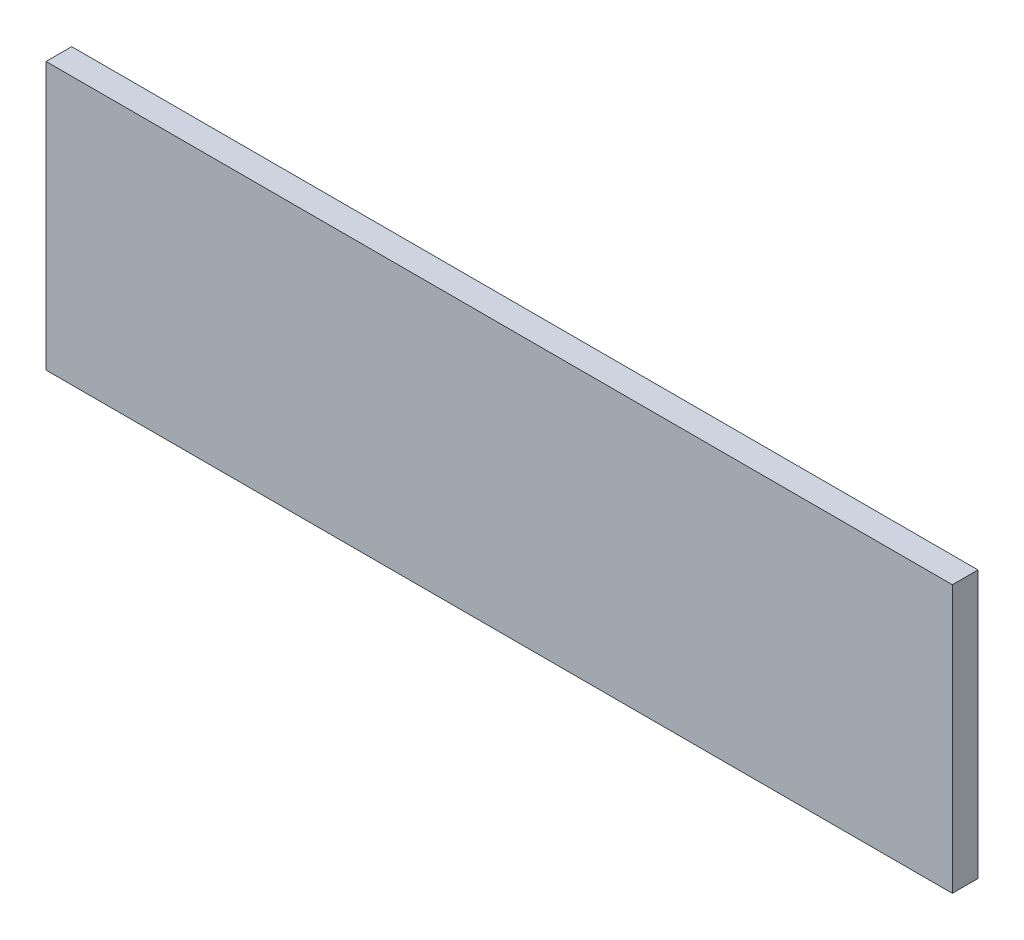
ISO-10303-21;
HEADER;
FILE_DESCRIPTION(('STEP AP214'),'2;1');
FILE_NAME('part.step','',(''),(''),'','','');
FILE_SCHEMA(('AUTOMOTIVE_DESIGN { 1 0 10303 214 1 1 1 1 }'));
ENDSEC;
DATA;
#1=APPLICATION_CONTEXT('core data for automotive mechanical design processes');
#2=APPLICATION_PROTOCOL_DEFINITION('international standard','automotive_design',2000,#1);
#3=PRODUCT_CONTEXT('',#1,'mechanical');
#4=PRODUCT('Part','Part','',(#3));
#5=PRODUCT_RELATED_PRODUCT_CATEGORY('part','',(#4));
#6=PRODUCT_DEFINITION_FORMATION('','',#4);
#7=PRODUCT_DEFINITION_CONTEXT('part definition',#1,'design');
#8=PRODUCT_DEFINITION('design','',#6,#7);
#9=PRODUCT_DEFINITION_SHAPE('','',#8);
#10=(LENGTH_UNIT() NAMED_UNIT(*) SI_UNIT(.MILLI.,.METRE.));
#11=(NAMED_UNIT(*) PLANE_ANGLE_UNIT() SI_UNIT($,.RADIAN.));
#12=(NAMED_UNIT(*) SI_UNIT($,.STERADIAN.) SOLID_ANGLE_UNIT());
#13=UNCERTAINTY_MEASURE_WITH_UNIT(LENGTH_MEASURE(1.E-05),#10,'distance_accuracy_value','');
#14=(GEOMETRIC_REPRESENTATION_CONTEXT(3) GLOBAL_UNCERTAINTY_ASSIGNED_CONTEXT((#13)) GLOBAL_UNIT_ASSIGNED_CONTEXT((#10,
#11,#12)) REPRESENTATION_CONTEXT('',''));
#15=CARTESIAN_POINT('',(0.,0.,0.));
#16=DIRECTION('',(0.,0.,1.));
#17=DIRECTION('',(1.,0.,0.));
#18=AXIS2_PLACEMENT_3D('',#15,#16,#17);
#19=CARTESIAN_POINT('',(2.11916772,-0.62500002,0.11999976));
#20=DIRECTION('',(0.,0.,1.));
#21=DIRECTION('',(1.,0.,0.));
#22=AXIS2_PLACEMENT_3D('',#19,#20,#21);
#23=PLANE('',#22);
#24=DIRECTION('',(0.,-1.,0.));
#25=VECTOR('',#24,1.);
#26=CARTESIAN_POINT('',(2.11916772,0.62500002,0.11999976));
#27=LINE('',#26,#25);
#28=CARTESIAN_POINT('',(2.11916772,0.62500002,0.11999976));
#29=VERTEX_POINT('',#28);
#30=CARTESIAN_POINT('',(2.11916772,-0.62500002,0.11999976));
#31=VERTEX_POINT('',#30);
#32=EDGE_CURVE('E28',#29,#31,#27,.T.);
#33=ORIENTED_EDGE('',*,*,#32,.F.);
#34=DIRECTION('',(1.,0.,0.));
#35=VECTOR('',#34,1.);
#36=CARTESIAN_POINT('',(-2.11916518,0.62500002,0.11999976));
#37=LINE('',#36,#35);
#38=CARTESIAN_POINT('',(-2.11916518,0.62500002,0.11999976));
#39=VERTEX_POINT('',#38);
#40=EDGE_CURVE('E73',#39,#29,#37,.T.);
#41=ORIENTED_EDGE('',*,*,#40,.F.);
#42=DIRECTION('',(0.,1.,0.));
#43=VECTOR('',#42,1.);
#44=CARTESIAN_POINT('',(-2.11916518,-0.62500002,0.11999976));
#45=LINE('',#44,#43);
#46=CARTESIAN_POINT('',(-2.11916518,-0.62500002,0.11999976));
#47=VERTEX_POINT('',#46);
#48=EDGE_CURVE('E76',#47,#39,#45,.T.);
#49=ORIENTED_EDGE('',*,*,#48,.F.);
#50=DIRECTION('',(-1.,0.,0.));
#51=VECTOR('',#50,1.);
#52=CARTESIAN_POINT('',(2.11916772,-0.62500002,0.11999976));
#53=LINE('',#52,#51);
#54=EDGE_CURVE('E103',#31,#47,#53,.T.);
#55=ORIENTED_EDGE('',*,*,#54,.F.);
#56=EDGE_LOOP('',(#33,#41,#49,#55));
#57=FACE_BOUND('',#56,.T.);
#58=ADVANCED_FACE('F17',(#57),#23,.T.);
#59=CARTESIAN_POINT('',(2.11916772,-0.62500002,0.));
#60=DIRECTION('',(0.,0.,1.));
#61=DIRECTION('',(1.,0.,0.));
#62=AXIS2_PLACEMENT_3D('',#59,#60,#61);
#63=PLANE('',#62);
#64=DIRECTION('',(-1.,0.,0.));
#65=VECTOR('',#64,1.);
#66=CARTESIAN_POINT('',(2.11916772,-0.62500002,0.));
#67=LINE('',#66,#65);
#68=CARTESIAN_POINT('',(2.11916772,-0.62500002,0.));
#69=VERTEX_POINT('',#68);
#70=CARTESIAN_POINT('',(-2.11916518,-0.62500002,0.));
#71=VERTEX_POINT('',#70);
#72=EDGE_CURVE('E92',#69,#71,#67,.T.);
#73=ORIENTED_EDGE('',*,*,#72,.T.);
#74=DIRECTION('',(0.,1.,0.));
#75=VECTOR('',#74,1.);
#76=CARTESIAN_POINT('',(-2.11916518,-0.62500002,0.));
#77=LINE('',#76,#75);
#78=CARTESIAN_POINT('',(-2.11916518,0.62500002,0.));
#79=VERTEX_POINT('',#78);
#80=EDGE_CURVE('E79',#71,#79,#77,.T.);
#81=ORIENTED_EDGE('',*,*,#80,.T.);
#82=DIRECTION('',(1.,0.,0.));
#83=VECTOR('',#82,1.);
#84=CARTESIAN_POINT('',(-2.11916518,0.62500002,0.));
#85=LINE('',#84,#83);
#86=CARTESIAN_POINT('',(2.11916772,0.62500002,0.));
#87=VERTEX_POINT('',#86);
#88=EDGE_CURVE('E65',#79,#87,#85,.T.);
#89=ORIENTED_EDGE('',*,*,#88,.T.);
#90=DIRECTION('',(0.,-1.,0.));
#91=VECTOR('',#90,1.);
#92=CARTESIAN_POINT('',(2.11916772,0.62500002,0.));
#93=LINE('',#92,#91);
#94=EDGE_CURVE('E11',#87,#69,#93,.T.);
#95=ORIENTED_EDGE('',*,*,#94,.T.);
#96=EDGE_LOOP('',(#73,#81,#89,#95));
#97=FACE_BOUND('',#96,.T.);
#98=ADVANCED_FACE('F19',(#97),#63,.F.);
#99=CARTESIAN_POINT('',(2.11916772,0.62500002,0.));
#100=DIRECTION('',(1.,0.,0.));
#101=DIRECTION('',(0.,1.,0.));
#102=AXIS2_PLACEMENT_3D('',#99,#100,#101);
#103=PLANE('',#102);
#104=DIRECTION('',(0.,0.,1.));
#105=VECTOR('',#104,1.);
#106=CARTESIAN_POINT('',(2.11916772,0.62500002,0.));
#107=LINE('',#106,#105);
#108=EDGE_CURVE('E21',#87,#29,#107,.T.);
#109=ORIENTED_EDGE('',*,*,#108,.T.);
#110=ORIENTED_EDGE('',*,*,#32,.T.);
#111=DIRECTION('',(0.,0.,1.));
#112=VECTOR('',#111,1.);
#113=CARTESIAN_POINT('',(2.11916772,-0.62500002,0.));
#114=LINE('',#113,#112);
#115=EDGE_CURVE('E100',#69,#31,#114,.T.);
#116=ORIENTED_EDGE('',*,*,#115,.F.);
#117=ORIENTED_EDGE('',*,*,#94,.F.);
#118=EDGE_LOOP('',(#109,#110,#116,#117));
#119=FACE_BOUND('',#118,.T.);
#120=ADVANCED_FACE('F171',(#119),#103,.T.);
#121=CARTESIAN_POINT('',(-2.11916518,0.62500002,0.));
#122=DIRECTION('',(0.,1.,0.));
#123=DIRECTION('',(1.,0.,0.));
#124=AXIS2_PLACEMENT_3D('',#121,#122,#123);
#125=PLANE('',#124);
#126=DIRECTION('',(0.,0.,1.));
#127=VECTOR('',#126,1.);
#128=CARTESIAN_POINT('',(-2.11916518,0.62500002,0.));
#129=LINE('',#128,#127);
#130=EDGE_CURVE('E82',#79,#39,#129,.T.);
#131=ORIENTED_EDGE('',*,*,#130,.T.);
#132=ORIENTED_EDGE('',*,*,#40,.T.);
#133=ORIENTED_EDGE('',*,*,#108,.F.);
#134=ORIENTED_EDGE('',*,*,#88,.F.);
#135=EDGE_LOOP('',(#131,#132,#133,#134));
#136=FACE_BOUND('',#135,.T.);
#137=ADVANCED_FACE('F83',(#136),#125,.T.);
#138=CARTESIAN_POINT('',(-2.11916518,-0.62500002,0.));
#139=DIRECTION('',(-1.,0.,0.));
#140=DIRECTION('',(0.,0.,1.));
#141=AXIS2_PLACEMENT_3D('',#138,#139,#140);
#142=PLANE('',#141);
#143=DIRECTION('',(0.,0.,1.));
#144=VECTOR('',#143,1.);
#145=CARTESIAN_POINT('',(-2.11916518,-0.62500002,0.));
#146=LINE('',#145,#144);
#147=EDGE_CURVE('E89',#71,#47,#146,.T.);
#148=ORIENTED_EDGE('',*,*,#147,.T.);
#149=ORIENTED_EDGE('',*,*,#48,.T.);
#150=ORIENTED_EDGE('',*,*,#130,.F.);
#151=ORIENTED_EDGE('',*,*,#80,.F.);
#152=EDGE_LOOP('',(#148,#149,#150,#151));
#153=FACE_BOUND('',#152,.T.);
#154=ADVANCED_FACE('F87',(#153),#142,.T.);
#155=CARTESIAN_POINT('',(2.11916772,-0.62500002,0.));
#156=DIRECTION('',(0.,-1.,0.));
#157=DIRECTION('',(0.,0.,-1.));
#158=AXIS2_PLACEMENT_3D('',#155,#156,#157);
#159=PLANE('',#158);
#160=ORIENTED_EDGE('',*,*,#115,.T.);
#161=ORIENTED_EDGE('',*,*,#54,.T.);
#162=ORIENTED_EDGE('',*,*,#147,.F.);
#163=ORIENTED_EDGE('',*,*,#72,.F.);
#164=EDGE_LOOP('',(#160,#161,#162,#163));
#165=FACE_BOUND('',#164,.T.);
#166=ADVANCED_FACE('F144',(#165),#159,.T.);
#167=CLOSED_SHELL('',(#58,#98,#120,#137,#154,#166));
#168=MANIFOLD_SOLID_BREP('B1',#167);
#169=ADVANCED_BREP_SHAPE_REPRESENTATION('',(#18,#168),#14);
#170=SHAPE_DEFINITION_REPRESENTATION(#9,#169);
ENDSEC;
END-ISO-10303-21;
